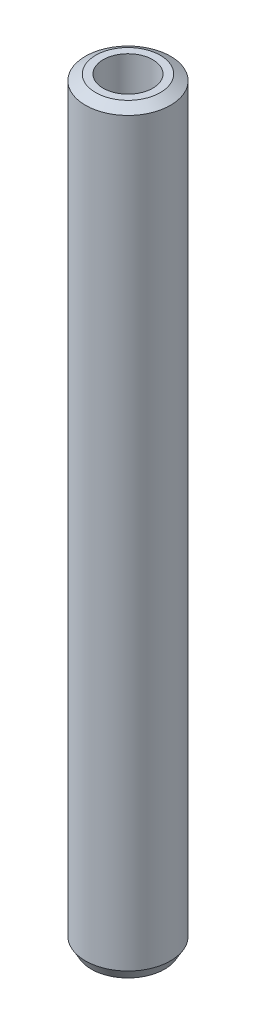
ISO-10303-21;
HEADER;
FILE_DESCRIPTION(('STEP AP214'),'2;1');
FILE_NAME('part.step','',(''),(''),'','','');
FILE_SCHEMA(('AUTOMOTIVE_DESIGN { 1 0 10303 214 1 1 1 1 }'));
ENDSEC;
DATA;
#1=APPLICATION_CONTEXT('core data for automotive mechanical design processes');
#2=APPLICATION_PROTOCOL_DEFINITION('international standard','automotive_design',2000,#1);
#3=PRODUCT_CONTEXT('',#1,'mechanical');
#4=PRODUCT('Part','Part','',(#3));
#5=PRODUCT_RELATED_PRODUCT_CATEGORY('part','',(#4));
#6=PRODUCT_DEFINITION_FORMATION('','',#4);
#7=PRODUCT_DEFINITION_CONTEXT('part definition',#1,'design');
#8=PRODUCT_DEFINITION('design','',#6,#7);
#9=PRODUCT_DEFINITION_SHAPE('','',#8);
#10=(LENGTH_UNIT() NAMED_UNIT(*) SI_UNIT(.MILLI.,.METRE.));
#11=(NAMED_UNIT(*) PLANE_ANGLE_UNIT() SI_UNIT($,.RADIAN.));
#12=(NAMED_UNIT(*) SI_UNIT($,.STERADIAN.) SOLID_ANGLE_UNIT());
#13=UNCERTAINTY_MEASURE_WITH_UNIT(LENGTH_MEASURE(1.E-05),#10,'distance_accuracy_value','');
#14=(GEOMETRIC_REPRESENTATION_CONTEXT(3) GLOBAL_UNCERTAINTY_ASSIGNED_CONTEXT((#13)) GLOBAL_UNIT_ASSIGNED_CONTEXT((#10,
#11,#12)) REPRESENTATION_CONTEXT('',''));
#15=CARTESIAN_POINT('',(0.,0.,0.));
#16=DIRECTION('',(0.,0.,1.));
#17=DIRECTION('',(1.,0.,0.));
#18=AXIS2_PLACEMENT_3D('',#15,#16,#17);
#19=CARTESIAN_POINT('',(0.,177.953678125411,0.));
#20=DIRECTION('',(0.,-1.,0.));
#21=DIRECTION('',(0.,0.,-1.));
#22=AXIS2_PLACEMENT_3D('',#19,#20,#21);
#23=CYLINDRICAL_SURFACE('',#22,10.);
#24=CARTESIAN_POINT('',(0.,176.571153778055,0.));
#25=DIRECTION('',(0.,1.,0.));
#26=DIRECTION('',(0.,0.,1.));
#27=AXIS2_PLACEMENT_3D('',#24,#25,#26);
#28=CIRCLE('',#27,10.);
#29=CARTESIAN_POINT('',(0.,176.571153778055,10.));
#30=VERTEX_POINT('',#29);
#31=EDGE_CURVE('E50',#30,#30,#28,.F.);
#32=ORIENTED_EDGE('',*,*,#31,.T.);
#33=EDGE_LOOP('',(#32));
#34=FACE_BOUND('',#33,.T.);
#35=CARTESIAN_POINT('',(0.,2.39460241232101,0.));
#36=DIRECTION('',(0.,1.,0.));
#37=DIRECTION('',(0.,0.,1.));
#38=AXIS2_PLACEMENT_3D('',#35,#36,#37);
#39=CIRCLE('',#38,10.);
#40=CARTESIAN_POINT('',(0.,2.39460241232101,10.));
#41=VERTEX_POINT('',#40);
#42=EDGE_CURVE('E51',#41,#41,#39,.T.);
#43=ORIENTED_EDGE('',*,*,#42,.T.);
#44=EDGE_LOOP('',(#43));
#45=FACE_BOUND('',#44,.T.);
#46=ADVANCED_FACE('F39',(#34,#45),#23,.T.);
#47=CARTESIAN_POINT('',(0.,177.953678125411,0.));
#48=DIRECTION('',(0.,1.,0.));
#49=DIRECTION('',(0.,0.,1.));
#50=AXIS2_PLACEMENT_3D('',#47,#48,#49);
#51=PLANE('',#50);
#52=CARTESIAN_POINT('',(0.,177.953678125411,0.));
#53=DIRECTION('',(0.,1.,0.));
#54=DIRECTION('',(0.,0.,1.));
#55=AXIS2_PLACEMENT_3D('',#52,#53,#54);
#56=CIRCLE('',#55,7.60539758767903);
#57=CARTESIAN_POINT('',(0.,177.953678125411,7.60539758767903));
#58=VERTEX_POINT('',#57);
#59=EDGE_CURVE('E54',#58,#58,#56,.T.);
#60=ORIENTED_EDGE('',*,*,#59,.T.);
#61=EDGE_LOOP('',(#60));
#62=FACE_BOUND('',#61,.T.);
#63=CARTESIAN_POINT('',(0.,177.953678125411,0.));
#64=DIRECTION('',(0.,1.,0.));
#65=DIRECTION('',(0.,0.,1.));
#66=AXIS2_PLACEMENT_3D('',#63,#64,#65);
#67=CIRCLE('',#66,5.82608710201551);
#68=CARTESIAN_POINT('',(0.,177.953678125411,5.82608710201551));
#69=VERTEX_POINT('',#68);
#70=EDGE_CURVE('E58',#69,#69,#67,.T.);
#71=ORIENTED_EDGE('',*,*,#70,.F.);
#72=EDGE_LOOP('',(#71));
#73=FACE_BOUND('',#72,.T.);
#74=ADVANCED_FACE('F69',(#62,#73),#51,.T.);
#75=CARTESIAN_POINT('',(0.,0.,0.));
#76=DIRECTION('',(0.,1.,0.));
#77=DIRECTION('',(0.,0.,1.));
#78=AXIS2_PLACEMENT_3D('',#75,#76,#77);
#79=PLANE('',#78);
#80=CARTESIAN_POINT('',(0.,0.,0.));
#81=DIRECTION('',(0.,1.,0.));
#82=DIRECTION('',(0.,0.,1.));
#83=AXIS2_PLACEMENT_3D('',#80,#81,#82);
#84=CIRCLE('',#83,8.61747565264433);
#85=CARTESIAN_POINT('',(0.,0.,8.61747565264433));
#86=VERTEX_POINT('',#85);
#87=EDGE_CURVE('E10',#86,#86,#84,.F.);
#88=ORIENTED_EDGE('',*,*,#87,.T.);
#89=EDGE_LOOP('',(#88));
#90=FACE_BOUND('',#89,.T.);
#91=CARTESIAN_POINT('',(0.,0.,0.));
#92=DIRECTION('',(0.,1.,0.));
#93=DIRECTION('',(0.,0.,1.));
#94=AXIS2_PLACEMENT_3D('',#91,#92,#93);
#95=CIRCLE('',#94,5.82608710201551);
#96=CARTESIAN_POINT('',(0.,0.,5.82608710201551));
#97=VERTEX_POINT('',#96);
#98=EDGE_CURVE('E63',#97,#97,#95,.T.);
#99=ORIENTED_EDGE('',*,*,#98,.T.);
#100=EDGE_LOOP('',(#99));
#101=FACE_BOUND('',#100,.T.);
#102=ADVANCED_FACE('F75',(#90,#101),#79,.F.);
#103=CARTESIAN_POINT('',(0.,177.953678125411,0.));
#104=DIRECTION('',(0.,-1.,0.));
#105=DIRECTION('',(0.,0.,-1.));
#106=AXIS2_PLACEMENT_3D('',#103,#104,#105);
#107=CYLINDRICAL_SURFACE('',#106,5.82608710201551);
#108=ORIENTED_EDGE('',*,*,#70,.T.);
#109=EDGE_LOOP('',(#108));
#110=FACE_BOUND('',#109,.T.);
#111=ORIENTED_EDGE('',*,*,#98,.F.);
#112=EDGE_LOOP('',(#111));
#113=FACE_BOUND('',#112,.T.);
#114=ADVANCED_FACE('F70',(#110,#113),#107,.F.);
#115=CARTESIAN_POINT('',(0.,177.953678125411,0.));
#116=DIRECTION('',(0.,-1.,0.));
#117=DIRECTION('',(0.,0.,-1.));
#118=AXIS2_PLACEMENT_3D('',#115,#116,#117);
#119=CONICAL_SURFACE('',#118,7.60539758767903,1.04719755119659);
#120=ORIENTED_EDGE('',*,*,#31,.F.);
#121=EDGE_LOOP('',(#120));
#122=FACE_BOUND('',#121,.T.);
#123=ORIENTED_EDGE('',*,*,#59,.F.);
#124=EDGE_LOOP('',(#123));
#125=FACE_BOUND('',#124,.T.);
#126=ADVANCED_FACE('F81',(#122,#125),#119,.T.);
#127=CARTESIAN_POINT('',(0.,2.39460241232101,0.));
#128=DIRECTION('',(0.,1.,0.));
#129=DIRECTION('',(0.,0.,1.));
#130=AXIS2_PLACEMENT_3D('',#127,#128,#129);
#131=CONICAL_SURFACE('',#130,10.,0.523598775598303);
#132=ORIENTED_EDGE('',*,*,#87,.F.);
#133=EDGE_LOOP('',(#132));
#134=FACE_BOUND('',#133,.T.);
#135=ORIENTED_EDGE('',*,*,#42,.F.);
#136=EDGE_LOOP('',(#135));
#137=FACE_BOUND('',#136,.T.);
#138=ADVANCED_FACE('F45',(#134,#137),#131,.T.);
#139=CLOSED_SHELL('',(#46,#74,#102,#114,#126,#138));
#140=MANIFOLD_SOLID_BREP('B2',#139);
#141=ADVANCED_BREP_SHAPE_REPRESENTATION('',(#18,#140),#14);
#142=SHAPE_DEFINITION_REPRESENTATION(#9,#141);
ENDSEC;
END-ISO-10303-21;
